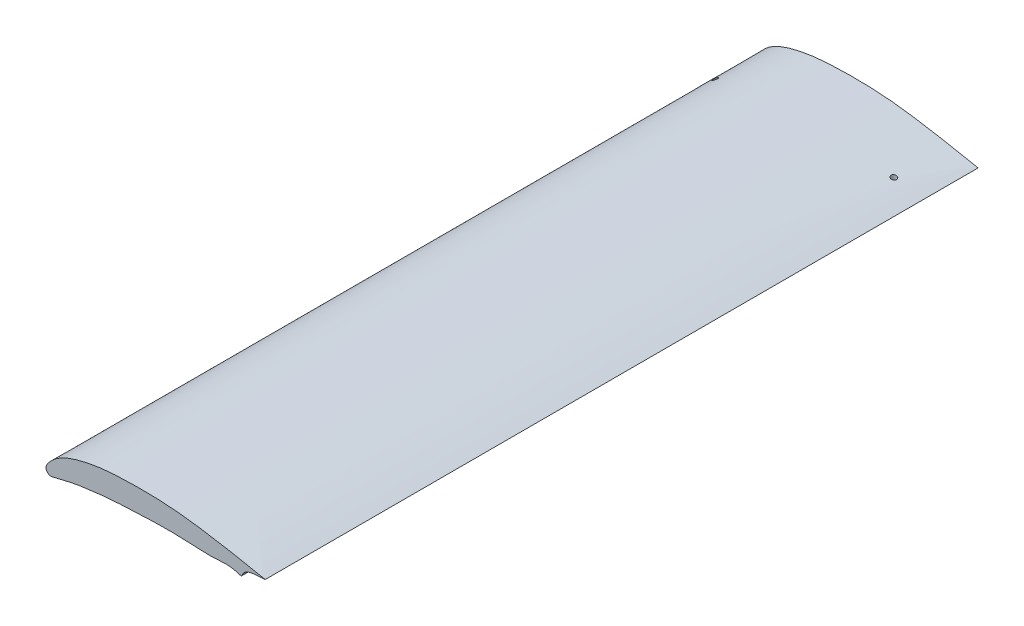
ISO-10303-21;
HEADER;
FILE_DESCRIPTION(('STEP AP214'),'2;1');
FILE_NAME('part.step','',(''),(''),'','','');
FILE_SCHEMA(('AUTOMOTIVE_DESIGN { 1 0 10303 214 1 1 1 1 }'));
ENDSEC;
DATA;
#1=APPLICATION_CONTEXT('core data for automotive mechanical design processes');
#2=APPLICATION_PROTOCOL_DEFINITION('international standard','automotive_design',2000,#1);
#3=PRODUCT_CONTEXT('',#1,'mechanical');
#4=PRODUCT('Part','Part','',(#3));
#5=PRODUCT_RELATED_PRODUCT_CATEGORY('part','',(#4));
#6=PRODUCT_DEFINITION_FORMATION('','',#4);
#7=PRODUCT_DEFINITION_CONTEXT('part definition',#1,'design');
#8=PRODUCT_DEFINITION('design','',#6,#7);
#9=PRODUCT_DEFINITION_SHAPE('','',#8);
#10=(LENGTH_UNIT() NAMED_UNIT(*) SI_UNIT(.MILLI.,.METRE.));
#11=(NAMED_UNIT(*) PLANE_ANGLE_UNIT() SI_UNIT($,.RADIAN.));
#12=(NAMED_UNIT(*) SI_UNIT($,.STERADIAN.) SOLID_ANGLE_UNIT());
#13=UNCERTAINTY_MEASURE_WITH_UNIT(LENGTH_MEASURE(1.E-05),#10,'distance_accuracy_value','');
#14=(GEOMETRIC_REPRESENTATION_CONTEXT(3) GLOBAL_UNCERTAINTY_ASSIGNED_CONTEXT((#13)) GLOBAL_UNIT_ASSIGNED_CONTEXT((#10,
#11,#12)) REPRESENTATION_CONTEXT('',''));
#15=CARTESIAN_POINT('',(0.,0.,0.));
#16=DIRECTION('',(0.,0.,1.));
#17=DIRECTION('',(1.,0.,0.));
#18=AXIS2_PLACEMENT_3D('',#15,#16,#17);
#19=CARTESIAN_POINT('',(198.755,12.4341128,647.7));
#20=CARTESIAN_POINT('',(197.958760534207,12.6748927876671,647.7));
#21=CARTESIAN_POINT('',(193.016318765984,13.5341691483497,647.7));
#22=CARTESIAN_POINT('',(188.294054353052,14.5184855232137,647.7));
#23=CARTESIAN_POINT('',(182.851726209752,15.5792373803848,647.7));
#24=CARTESIAN_POINT('',(170.951086300742,17.9688843917049,647.7));
#25=CARTESIAN_POINT('',(152.18858023146,21.2694516287347,647.7));
#26=CARTESIAN_POINT('',(126.821055620499,25.2076705512237,647.7));
#27=CARTESIAN_POINT('',(101.321432860715,27.1488490847707,647.7));
#28=CARTESIAN_POINT('',(75.878614337832,27.1749294150967,647.7));
#29=CARTESIAN_POINT('',(54.6349447143683,26.1939964805651,647.7));
#30=CARTESIAN_POINT('',(37.7206187463368,23.4738419295211,647.7));
#31=CARTESIAN_POINT('',(27.1377693436515,20.862450997991,647.7));
#32=CARTESIAN_POINT('',(18.6997974345567,17.8336240052125,647.7));
#33=CARTESIAN_POINT('',(12.2232756225657,14.7175392304468,647.7));
#34=CARTESIAN_POINT('',(6.86322263938597,10.8530181117352,647.7));
#35=CARTESIAN_POINT('',(2.51263926524156,6.22481514297062,647.7));
#36=CARTESIAN_POINT('',(-1.7331044962043,0.897280663114527,647.7));
#37=CARTESIAN_POINT('',(2.55754098739132,-4.25639395976814,647.7));
#38=CARTESIAN_POINT('',(7.56201719548681,-3.18649903825616,647.7));
#39=CARTESIAN_POINT('',(12.6976154233122,-1.98023294648634,647.7));
#40=CARTESIAN_POINT('',(19.0474899754093,-0.424332295492845,647.7));
#41=CARTESIAN_POINT('',(27.4304732379743,1.4859270437852,647.7));
#42=CARTESIAN_POINT('',(38.051074580332,2.87200975582277,647.7));
#43=CARTESIAN_POINT('',(54.9212142330804,5.06075420952236,647.7));
#44=CARTESIAN_POINT('',(76.0959932993087,6.25150550165955,647.7));
#45=CARTESIAN_POINT('',(101.556610570524,7.37317506510794,647.7));
#46=CARTESIAN_POINT('',(126.711669410679,7.31735993311027,647.7));
#47=CARTESIAN_POINT('',(152.222032299856,5.02865408070531,647.7));
#48=CARTESIAN_POINT('',(166.885209380243,7.94350036404351,647.7));
#49=CARTESIAN_POINT('',(177.478911207929,3.86078185870248,647.7));
#50=CARTESIAN_POINT('',(178.973218605266,7.14619357827708,647.7));
#51=CARTESIAN_POINT('',(183.205786263873,13.0926636509751,647.7));
#52=CARTESIAN_POINT('',(201.125228022937,11.7173642605855,647.7));
#53=CARTESIAN_POINT('',(198.755,12.4341128,647.7));
#54=B_SPLINE_CURVE_WITH_KNOTS('',3,(#19,#20,#21,#22,#23,#24,#25,#26,#27,#28,#29,#30,#31,#32,#33,
#34,#35,#36,#37,#38,#39,#40,#41,#42,#43,#44,#45,#46,#47,#48,#49,#50,#51,#52,#53),.UNSPECIFIED.,
.T.,.F.,(4,1,1,1,1,1,1,1,1,1,1,1,1,1,1,1,1,1,1,1,1,1,1,1,1,1,1,1,1,1,1,1,4),(0.,
0.0130652849117943,0.0261249114312724,0.0391939832046235,0.0522592681164178,0.114883725942391,
0.177153764537816,0.238898973149273,0.300426495876215,0.362023645270243,0.393128504191607,
0.424784776009081,0.44109166189645,0.458148008143755,0.477060579176118,0.48802083829335,
0.50604562016283,0.51777668525792,0.525474169458793,0.541223289905193,0.556994005380544,
0.572702865712309,0.603759277327333,0.634700771494563,0.696321727579434,0.757859990174522,
0.819389386006446,0.880956138609047,0.936472049316192,0.942641551592999,0.944142164687157,
0.961107548977415,1.),.UNSPECIFIED.);
#55=DIRECTION('',(0.,0.,-1.));
#56=VECTOR('',#55,1.);
#57=SURFACE_OF_LINEAR_EXTRUSION('',#54,#56);
#58=CARTESIAN_POINT('',(13.2315396177122,15.0484347914961,50.8));
#59=CARTESIAN_POINT('',(13.2315322849885,15.0484311890282,50.9313661934099));
#60=CARTESIAN_POINT('',(13.2215795019761,15.0428129120174,51.0627998767818));
#61=CARTESIAN_POINT('',(13.18221591222,15.020532771465,51.3218071664005));
#62=CARTESIAN_POINT('',(13.1527901057857,15.003862394688,51.4493777176731));
#63=CARTESIAN_POINT('',(13.0759224611812,14.9601209445801,51.6967403510377));
#64=CARTESIAN_POINT('',(13.0285208534924,14.9330730948285,51.8165491083259));
#65=CARTESIAN_POINT('',(12.917714636927,14.8694681568995,52.0457298351831));
#66=CARTESIAN_POINT('',(12.8543099674338,14.8329110327028,52.1551017652171));
#67=CARTESIAN_POINT('',(12.7112385623374,14.7498174506164,52.3650881315765));
#68=CARTESIAN_POINT('',(12.6310476956563,14.702955995544,52.4652152298003));
#69=CARTESIAN_POINT('',(12.4588552205819,14.6014441641143,52.6501535054709));
#70=CARTESIAN_POINT('',(12.366849857487,14.5467913110037,52.7349597931815));
#71=CARTESIAN_POINT('',(12.1642847509017,14.4252955478085,52.8958092744233));
#72=CARTESIAN_POINT('',(12.0527900547579,14.3577821554167,52.9701661809602));
#73=CARTESIAN_POINT('',(11.822295922671,14.21661016033,53.0986095726129));
#74=CARTESIAN_POINT('',(11.703292992956,14.1429486915542,53.1526865384665));
#75=CARTESIAN_POINT('',(11.4465143187519,13.9821025332321,53.2456650669561));
#76=CARTESIAN_POINT('',(11.3081777151838,13.8943466634967,53.2820309810548));
#77=CARTESIAN_POINT('',(11.0295756965157,13.7151865322346,53.3296802931591));
#78=CARTESIAN_POINT('',(10.8893094658056,13.6237806948229,53.3409527351401));
#79=CARTESIAN_POINT('',(10.5954765507619,13.4296681915411,53.3388158833271));
#80=CARTESIAN_POINT('',(10.4420472708968,13.3267766019868,53.3227117642547));
#81=CARTESIAN_POINT('',(10.1405949124551,13.1216094250332,53.261209581994));
#82=CARTESIAN_POINT('',(9.99257600979395,13.0193343622934,53.2157893758862));
#83=CARTESIAN_POINT('',(9.69967005161016,12.8140724555134,53.0936287013672));
#84=CARTESIAN_POINT('',(9.55519564645956,12.7112463018795,53.0156180440947));
#85=CARTESIAN_POINT('',(9.28132237661272,12.513670915777,52.8289349823251));
#86=CARTESIAN_POINT('',(9.15190463156049,12.4189116087671,52.7203015757636));
#87=CARTESIAN_POINT('',(8.94267686371422,12.2639296192098,52.5034916692055));
#88=CARTESIAN_POINT('',(8.85844065511549,12.2008982639155,52.4015652530145));
#89=CARTESIAN_POINT('',(8.7048109550114,12.0850795703158,52.1817077467296));
#90=CARTESIAN_POINT('',(8.63540974224333,12.0322869043489,52.0637850348277));
#91=CARTESIAN_POINT('',(8.54475881301422,11.9629403757375,51.8761562338837));
#92=CARTESIAN_POINT('',(8.5166831679517,11.9413869702349,51.8114903592339));
#93=CARTESIAN_POINT('',(8.46559023617875,11.9020655185663,51.6790953262595));
#94=CARTESIAN_POINT('',(8.44257019960163,11.8842954147335,51.6113678575047));
#95=CARTESIAN_POINT('',(8.40199264806558,11.8529118372569,51.4734047548836));
#96=CARTESIAN_POINT('',(8.38443186776419,11.8392958789868,51.4031706484479));
#97=CARTESIAN_POINT('',(8.35509044936922,11.8165163722954,51.2607995165565));
#98=CARTESIAN_POINT('',(8.34330874791038,11.807352004773,51.1886628437538));
#99=CARTESIAN_POINT('',(8.3270088251908,11.7946649802624,51.0535306445394));
#100=CARTESIAN_POINT('',(8.32169843927913,11.7905272965369,50.9906867836345));
#101=CARTESIAN_POINT('',(8.3155950066163,11.78577125844,50.8646244707102));
#102=CARTESIAN_POINT('',(8.3148033772124,11.7851540082832,50.8014059073854));
#103=CARTESIAN_POINT('',(8.31775616790872,11.7874553718774,50.6751816447847));
#104=CARTESIAN_POINT('',(8.32149738263138,11.7903714870271,50.6121758266467));
#105=CARTESIAN_POINT('',(8.33344454364528,11.799675116304,50.4868402016706));
#106=CARTESIAN_POINT('',(8.34165216043134,11.8060639292661,50.4245106566696));
#107=CARTESIAN_POINT('',(8.37137774970867,11.8291721064418,50.2477903185408));
#108=CARTESIAN_POINT('',(8.39827145726279,11.8500499120184,50.1347811603276));
#109=CARTESIAN_POINT('',(8.46582019533859,11.9022560756455,49.9156045408629));
#110=CARTESIAN_POINT('',(8.50647753151005,11.9335861846278,49.809438229458));
#111=CARTESIAN_POINT('',(8.60308510147422,12.0076057951546,49.5987948190004));
#112=CARTESIAN_POINT('',(8.65989517211755,12.0509286215046,49.4949366957694));
#113=CARTESIAN_POINT('',(8.78517132066887,12.1457661503275,49.2986645074915));
#114=CARTESIAN_POINT('',(8.85364300748937,12.1972847939704,49.2062559865054));
#115=CARTESIAN_POINT('',(9.01148317655401,12.3150695043584,49.0205325985599));
#116=CARTESIAN_POINT('',(9.10244601680173,12.3823859656702,48.9292412069546));
#117=CARTESIAN_POINT('',(9.29456704463545,12.5230819413099,48.7636778537828));
#118=CARTESIAN_POINT('',(9.39573132297943,12.59646507297,48.6894161474317));
#119=CARTESIAN_POINT('',(9.62369411825985,12.7599966745476,48.5472352386966));
#120=CARTESIAN_POINT('',(9.75194171874278,12.8508884723797,48.4824857863808));
#121=CARTESIAN_POINT('',(10.0160692899433,13.0355560833673,48.3771331283401));
#122=CARTESIAN_POINT('',(10.1519536821747,13.1293335527396,48.3365440718395));
#123=CARTESIAN_POINT('',(10.4441562747405,13.3282192609752,48.2767795017799));
#124=CARTESIAN_POINT('',(10.6010399992105,13.4334024050491,48.2605667308384));
#125=CARTESIAN_POINT('',(10.9163911987713,13.6416090196084,48.259461786156));
#126=CARTESIAN_POINT('',(11.0748591379311,13.7446318281525,48.2745790744998));
#127=CARTESIAN_POINT('',(11.3907531848853,13.9469565404663,48.3373641346888));
#128=CARTESIAN_POINT('',(11.5481434658291,14.0461983130007,48.3854236820776));
#129=CARTESIAN_POINT('',(11.7774050285613,14.1887340850455,48.4823892415273));
#130=CARTESIAN_POINT('',(11.8527238069716,14.2352129519521,48.5188813512439));
#131=CARTESIAN_POINT('',(12.0003175914266,14.325672833576,48.6001339613381));
#132=CARTESIAN_POINT('',(12.0725944309023,14.3696553586214,48.6448893910244));
#133=CARTESIAN_POINT('',(12.2073136344919,14.4511079079645,48.7384331382068));
#134=CARTESIAN_POINT('',(12.2700712846313,14.4888143264194,48.7865628116069));
#135=CARTESIAN_POINT('',(12.3915850015946,14.5614192967877,48.8894612184962));
#136=CARTESIAN_POINT('',(12.4503434741955,14.5963195391404,48.9442259044466));
#137=CARTESIAN_POINT('',(12.5631395898419,14.6629752274741,49.0601278690422));
#138=CARTESIAN_POINT('',(12.6171787097992,14.6947316577234,49.1212631407946));
#139=CARTESIAN_POINT('',(12.7197977847176,14.7547619364637,49.2495309087132));
#140=CARTESIAN_POINT('',(12.7683786919852,14.7830363925456,49.3166623550329));
#141=CARTESIAN_POINT('',(12.8534840596834,14.8323726131557,49.4474084452876));
#142=CARTESIAN_POINT('',(12.8907555326212,14.8538943255919,49.5103645878932));
#143=CARTESIAN_POINT('',(12.9601170460225,14.8938264358991,49.6400023825987));
#144=CARTESIAN_POINT('',(12.9922079339293,14.9122373426607,49.7066834229704));
#145=CARTESIAN_POINT('',(13.050733402202,14.945731757139,49.8431697254687));
#146=CARTESIAN_POINT('',(13.0771762494525,14.9608201289763,49.9129702380875));
#147=CARTESIAN_POINT('',(13.1240773375714,14.9875313002805,50.0551642657139));
#148=CARTESIAN_POINT('',(13.1445374640806,14.9991551917086,50.1275569556241));
#149=CARTESIAN_POINT('',(13.184862102967,15.0220351556491,50.2984423461881));
#150=CARTESIAN_POINT('',(13.2023265661239,15.0319180398842,50.3977022034573));
#151=CARTESIAN_POINT('',(13.2256673819954,15.045118811827,50.5979615522002));
#152=CARTESIAN_POINT('',(13.231545257614,15.0484375623036,50.6989608132916));
#153=CARTESIAN_POINT('',(13.2315396177122,15.0484347914961,50.8));
#154=B_SPLINE_CURVE_WITH_KNOTS('',3,(#58,#59,#60,#61,#62,#63,#64,#65,#66,#67,#68,#69,#70,#71,
#72,#73,#74,#75,#76,#77,#78,#79,#80,#81,#82,#83,#84,#85,#86,#87,#88,#89,#90,#91,#92,#93,#94,#95,
#96,#97,#98,#99,#100,#101,#102,#103,#104,#105,#106,#107,#108,#109,#110,#111,#112,#113,#114,#115,
#116,#117,#118,#119,#120,#121,#122,#123,#124,#125,#126,#127,#128,#129,#130,#131,#132,#133,#134,
#135,#136,#137,#138,#139,#140,#141,#142,#143,#144,#145,#146,#147,#148,#149,#150,#151,#152,#153),
.UNSPECIFIED.,.T.,.F.,(4,2,2,2,2,2,2,2,2,2,2,2,2,2,2,2,2,2,2,2,2,2,2,2,2,2,2,2,2,2,2,2,2,2,2,2,
2,2,2,2,2,2,2,2,2,2,2,4),(0.,0.393728209990927,0.787760054717573,1.18091519737844,
1.57407182926023,1.98209047111918,2.39023910560192,2.83859535465758,3.28716179636661,
3.78853029000402,4.29011764251876,4.84398146192904,5.39826411406561,5.97653059762444,
6.55406396272133,6.99184923096567,7.4294060845654,7.6502865700373,7.87104661411498,
8.09167435990135,8.31226149437675,8.50161991813696,8.69103773255153,8.88032167926846,
9.06967646944899,9.42206631269688,9.77451521667437,10.151217495382,10.5281014717229,
10.9626343083581,11.3974281359493,11.905381835934,12.4136327205238,12.9797264572076,
13.5459911864636,14.119109971282,14.4059532937221,14.6926211795619,14.9551076740522,
15.2174348433218,15.4796796214305,15.7418785738114,15.9703483509682,16.1987807169458,
16.4268764060455,16.6549001260026,16.957772630271,17.2606053232875),.UNSPECIFIED.);
#155=CARTESIAN_POINT('',(13.2315396177122,15.0484347914961,50.8));
#156=VERTEX_POINT('',#155);
#157=EDGE_CURVE('E44',#156,#156,#154,.T.);
#158=ORIENTED_EDGE('',*,*,#157,.T.);
#159=EDGE_LOOP('',(#158));
#160=FACE_BOUND('',#159,.T.);
#161=CARTESIAN_POINT('',(14.1056423701573,-1.63043930702744,50.7999999999999));
#162=CARTESIAN_POINT('',(14.1056359002599,-1.63044088544523,50.6591207650782));
#163=CARTESIAN_POINT('',(14.0940100932554,-1.63324953335712,50.518138068398));
#164=CARTESIAN_POINT('',(14.0478295900166,-1.6444046447402,50.2400881548447));
#165=CARTESIAN_POINT('',(14.0132471244181,-1.65275781510372,50.103025890002));
#166=CARTESIAN_POINT('',(13.9222520317104,-1.67473151991666,49.836920209636));
#167=CARTESIAN_POINT('',(13.8658577515508,-1.68834762745432,49.7078701602522));
#168=CARTESIAN_POINT('',(13.7329740463239,-1.72041887761804,49.4612797076177));
#169=CARTESIAN_POINT('',(13.6564889800746,-1.73887297061209,49.3437368154032));
#170=CARTESIAN_POINT('',(13.4850342934077,-1.78021666160759,49.1224363265474));
#171=CARTESIAN_POINT('',(13.3899284640594,-1.80313893810291,49.0187904169811));
#172=CARTESIAN_POINT('',(13.184376540603,-1.85263965595237,48.8290714285328));
#173=CARTESIAN_POINT('',(13.0739287249683,-1.8792185076081,48.7430003244029));
#174=CARTESIAN_POINT('',(12.8389272838399,-1.93570789423596,48.5894023221915));
#175=CARTESIAN_POINT('',(12.7141752125168,-1.96566517310938,48.522196238672));
#176=CARTESIAN_POINT('',(12.4555669122732,-2.02767742658107,48.4099117805263));
#177=CARTESIAN_POINT('',(12.3217099091568,-2.05973257955362,48.3648352902729));
#178=CARTESIAN_POINT('',(12.0465376417516,-2.12551838522368,48.2974402664555));
#179=CARTESIAN_POINT('',(11.9051408138995,-2.15926691807164,48.2754718991183));
#180=CARTESIAN_POINT('',(11.6207305827922,-2.22701823433337,48.2560607103547));
#181=CARTESIAN_POINT('',(11.4777170967868,-2.26102103073143,48.2586191500864));
#182=CARTESIAN_POINT('',(11.1930646403468,-2.32855650318531,48.2883175805383));
#183=CARTESIAN_POINT('',(11.0514425480505,-2.36208415256104,48.315631320185));
#184=CARTESIAN_POINT('',(10.7746646851465,-2.42746225620204,48.3943955374379));
#185=CARTESIAN_POINT('',(10.6395088904564,-2.45931271671371,48.4458459251442));
#186=CARTESIAN_POINT('',(10.380104165388,-2.52030687215419,48.5712996517289));
#187=CARTESIAN_POINT('',(10.2558152861222,-2.54946050624868,48.6452154902817));
#188=CARTESIAN_POINT('',(10.0212614707003,-2.60436220065034,48.8136902290561));
#189=CARTESIAN_POINT('',(9.91099566226898,-2.63011047278479,48.9082478443051));
#190=CARTESIAN_POINT('',(9.70914868177326,-2.67715552810202,49.1140706327464));
#191=CARTESIAN_POINT('',(9.61734883322132,-2.6985044929569,49.22510937103));
#192=CARTESIAN_POINT('',(9.45353863058069,-2.7365423885127,49.4616443471345));
#193=CARTESIAN_POINT('',(9.38152653528017,-2.75323172923661,49.5871393115081));
#194=CARTESIAN_POINT('',(9.26051029784535,-2.78124767565336,49.8469349462055));
#195=CARTESIAN_POINT('',(9.21116750480527,-2.79265323752397,49.9810693880785));
#196=CARTESIAN_POINT('',(9.13541350615318,-2.8101534782741,50.2559941343449));
#197=CARTESIAN_POINT('',(9.10900059176602,-2.81624855290065,50.3967839419439));
#198=CARTESIAN_POINT('',(9.0801111469783,-2.82291470471949,50.6792639133506));
#199=CARTESIAN_POINT('',(9.07735949936203,-2.82354927304987,50.8209245077723));
#200=CARTESIAN_POINT('',(9.09515599784276,-2.81944327955315,51.1026921928639));
#201=CARTESIAN_POINT('',(9.1157033880526,-2.81470289210492,51.2427993337834));
#202=CARTESIAN_POINT('',(9.17935052135563,-2.80000502985702,51.5170097150136));
#203=CARTESIAN_POINT('',(9.22237501724347,-2.79006496202279,51.6511313768034));
#204=CARTESIAN_POINT('',(9.3296161079319,-2.76525389635712,51.9101218629536));
#205=CARTESIAN_POINT('',(9.39383308999256,-2.75038280841885,52.0349905181784));
#206=CARTESIAN_POINT('',(9.54198633036902,-2.71601303193683,52.2727828800937));
#207=CARTESIAN_POINT('',(9.62604017199237,-2.6964867422897,52.385629300068));
#208=CARTESIAN_POINT('',(9.81116859085435,-2.65339080929964,52.5954694617799));
#209=CARTESIAN_POINT('',(9.91224421005577,-2.62982091843202,52.6924622323433));
#210=CARTESIAN_POINT('',(10.1299438020108,-2.57894086416272,52.869227481127));
#211=CARTESIAN_POINT('',(10.2467551616584,-2.55158549407073,52.9487561199039));
#212=CARTESIAN_POINT('',(10.4915347516541,-2.49412674263428,53.0868960590585));
#213=CARTESIAN_POINT('',(10.6195038773955,-2.46402314073937,53.1455056787918));
#214=CARTESIAN_POINT('',(10.8850516253359,-2.40141015782553,53.241064634487));
#215=CARTESIAN_POINT('',(11.0227469730838,-2.36887110488155,53.2776702608422));
#216=CARTESIAN_POINT('',(11.3021091100338,-2.3027074128316,53.3268957937962));
#217=CARTESIAN_POINT('',(11.4437761875492,-2.26908269488868,53.3395139545127));
#218=CARTESIAN_POINT('',(11.7287128019531,-2.20131644512263,53.340463567553));
#219=CARTESIAN_POINT('',(11.8719829128922,-2.16717328392113,53.3285277863771));
#220=CARTESIAN_POINT('',(12.1545293975912,-2.09971954691095,53.2801413835387));
#221=CARTESIAN_POINT('',(12.2938056610729,-2.06640899409556,53.2436900856305));
#222=CARTESIAN_POINT('',(12.5645875697853,-2.00155084137826,53.147146056854));
#223=CARTESIAN_POINT('',(12.6960819105185,-1.97000580962186,53.0870198592541));
#224=CARTESIAN_POINT('',(12.9472405965886,-1.90968365619012,52.9447136305994));
#225=CARTESIAN_POINT('',(13.0669058497322,-1.88090632211632,52.8625352937059));
#226=CARTESIAN_POINT('',(13.2897549098596,-1.82727035241211,52.6792321683838));
#227=CARTESIAN_POINT('',(13.3930846499068,-1.80237704853852,52.5782950175401));
#228=CARTESIAN_POINT('',(13.5814928872196,-1.75696175996016,52.3597200878312));
#229=CARTESIAN_POINT('',(13.6665683496502,-1.73644050212671,52.2420795373639));
#230=CARTESIAN_POINT('',(13.8145850977559,-1.70072445588786,51.995445631288));
#231=CARTESIAN_POINT('',(13.8778518789344,-1.68545135058422,51.8666587078039));
#232=CARTESIAN_POINT('',(13.9820191582097,-1.66029976132539,51.5999717163757));
#233=CARTESIAN_POINT('',(14.0229494877323,-1.65041408222276,51.462084080305));
#234=CARTESIAN_POINT('',(14.0698766523244,-1.6390791687287,51.2360264797968));
#235=CARTESIAN_POINT('',(14.0832705027888,-1.63584370524876,51.1494098791279));
#236=CARTESIAN_POINT('',(14.1011553336132,-1.63152329322803,50.9752088549669));
#237=CARTESIAN_POINT('',(14.1056463943212,-1.63043832527895,50.8876244402165));
#238=CARTESIAN_POINT('',(14.1056423701573,-1.63043930702744,50.7999999999999));
#239=B_SPLINE_CURVE_WITH_KNOTS('',3,(#161,#162,#163,#164,#165,#166,#167,#168,#169,#170,#171,
#172,#173,#174,#175,#176,#177,#178,#179,#180,#181,#182,#183,#184,#185,#186,#187,#188,#189,#190,
#191,#192,#193,#194,#195,#196,#197,#198,#199,#200,#201,#202,#203,#204,#205,#206,#207,#208,#209,
#210,#211,#212,#213,#214,#215,#216,#217,#218,#219,#220,#221,#222,#223,#224,#225,#226,#227,#228,
#229,#230,#231,#232,#233,#234,#235,#236,#237,#238),.UNSPECIFIED.,.T.,.F.,(4,2,2,2,2,2,2,2,2,2,2,
2,2,2,2,2,2,2,2,2,2,2,2,2,2,2,2,2,2,2,2,2,2,2,2,2,2,2,4),(0.,0.422314922958448,
0.845141629421219,1.26761344710904,1.68999368256644,2.11558752159738,2.54122915520778,
2.97372246799858,3.4062526019525,3.84524655054166,4.28426307213605,4.72638496521152,
5.1685052115621,5.60892505119286,6.04931748203172,6.48414003337103,6.91892431049149,
7.34698348188117,7.77501075080481,8.19805438046061,8.62108428576863,9.04270699264542,
9.46433740445502,9.88853275355587,10.3127540785885,10.7425672229118,11.1724148908702,
11.6088133337503,12.0452435378507,12.4864487631986,12.927666159426,13.3695095107098,
13.8113189269785,14.2489262054784,14.6866061813814,15.1174379821943,15.5476929690018,
15.8103678956282,16.0730404515938),.UNSPECIFIED.);
#240=CARTESIAN_POINT('',(14.1056423701573,-1.63043930702744,50.7999999999999));
#241=VERTEX_POINT('',#240);
#242=EDGE_CURVE('E107',#241,#241,#239,.T.);
#243=ORIENTED_EDGE('',*,*,#242,.T.);
#244=EDGE_LOOP('',(#243));
#245=FACE_BOUND('',#244,.T.);
#246=CARTESIAN_POINT('',(175.914710282943,16.954981902588,50.8));
#247=CARTESIAN_POINT('',(175.914703492226,16.954983259304,50.9395651484845));
#248=CARTESIAN_POINT('',(175.903028243029,16.9572455696789,51.0792344305187));
#249=CARTESIAN_POINT('',(175.85667812831,16.9662230583004,51.3546695199144));
#250=CARTESIAN_POINT('',(175.821975075049,16.9729436938648,51.4904303302482));
#251=CARTESIAN_POINT('',(175.730757143087,16.9905966825293,51.7539563448168));
#252=CARTESIAN_POINT('',(175.674266500912,17.0015243556942,51.8817302508018));
#253=CARTESIAN_POINT('',(175.541299253365,17.027221558128,52.1259355581518));
#254=CARTESIAN_POINT('',(175.464826545349,17.0419903382146,52.2423691652864));
#255=CARTESIAN_POINT('',(175.293114071365,17.0751139228384,52.4623585802182));
#256=CARTESIAN_POINT('',(175.197642821906,17.0935129329039,52.5657268862747));
#257=CARTESIAN_POINT('',(174.991414723389,17.1332029479179,52.7552187871989));
#258=CARTESIAN_POINT('',(174.880655444658,17.1544944125456,52.841339635646));
#259=CARTESIAN_POINT('',(174.64369948167,17.1999768009592,52.9964443624902));
#260=CARTESIAN_POINT('',(174.517158304908,17.2242320470949,53.0648830701911));
#261=CARTESIAN_POINT('',(174.254781200709,17.2744415928359,53.1797926193216));
#262=CARTESIAN_POINT('',(174.118943932982,17.3003961374191,53.2262602853404));
#263=CARTESIAN_POINT('',(173.838022698228,17.3539808228254,53.2970900386506));
#264=CARTESIAN_POINT('',(173.692789864308,17.3816370253969,53.3208428122257));
#265=CARTESIAN_POINT('',(173.400442096881,17.4372101618598,53.3435525016485));
#266=CARTESIAN_POINT('',(173.253326985609,17.4651271203093,53.3425070579605));
#267=CARTESIAN_POINT('',(172.959332302392,17.5208205654661,53.3154480672281));
#268=CARTESIAN_POINT('',(172.8124817249,17.5485902800301,53.2891036010073));
#269=CARTESIAN_POINT('',(172.525228635226,17.6028206309313,53.2115678700295));
#270=CARTESIAN_POINT('',(172.384826145989,17.6292812626103,53.1603765168645));
#271=CARTESIAN_POINT('',(172.115351487836,17.6799901222416,53.0347294713662));
#272=CARTESIAN_POINT('',(171.986222207655,17.7042495298365,52.9604009518001));
#273=CARTESIAN_POINT('',(171.74240827959,17.7499935801056,52.7902783568312));
#274=CARTESIAN_POINT('',(171.627722089979,17.7714785189467,52.6944865755636));
#275=CARTESIAN_POINT('',(171.41878200055,17.8105769710914,52.4863150225836));
#276=CARTESIAN_POINT('',(171.324139257109,17.8282642760265,52.374339603189));
#277=CARTESIAN_POINT('',(171.155312073035,17.8597885847347,52.1354185550999));
#278=CARTESIAN_POINT('',(171.081124222782,17.8736262302098,52.0084754264112));
#279=CARTESIAN_POINT('',(170.957505906511,17.896670166062,51.7470576047541));
#280=CARTESIAN_POINT('',(170.907439186371,17.9059955122753,51.6128941798973));
#281=CARTESIAN_POINT('',(170.830718466101,17.9202810292484,51.3378125858172));
#282=CARTESIAN_POINT('',(170.804061114481,17.9252418248755,51.1968953865704));
#283=CARTESIAN_POINT('',(170.77539140986,17.9305769557877,50.9156065346233));
#284=CARTESIAN_POINT('',(170.772854386474,17.9310489328659,50.7752899771086));
#285=CARTESIAN_POINT('',(170.791139053542,17.9276465403794,50.4962469173264));
#286=CARTESIAN_POINT('',(170.811959364643,17.92377242747,50.3575203216535));
#287=CARTESIAN_POINT('',(170.876060701945,17.911838911154,50.0864746826829));
#288=CARTESIAN_POINT('',(170.919200584396,17.9038058080122,49.9541210212731));
#289=CARTESIAN_POINT('',(171.026469249811,17.8838165468284,49.6985388980234));
#290=CARTESIAN_POINT('',(171.090598800377,17.8718602453128,49.5753107701113));
#291=CARTESIAN_POINT('',(171.238704289438,17.8442210639397,49.3398956529307));
#292=CARTESIAN_POINT('',(171.322899552086,17.8284969900968,49.2278516103817));
#293=CARTESIAN_POINT('',(171.508176807827,17.7938547058766,49.019306942931));
#294=CARTESIAN_POINT('',(171.609260651204,17.7749361455145,48.9228080234034));
#295=CARTESIAN_POINT('',(171.828027108465,17.733937722758,48.7455719408469));
#296=CARTESIAN_POINT('',(171.946052338653,17.7117924123795,48.6652729438097));
#297=CARTESIAN_POINT('',(172.193384972593,17.6653148020188,48.5253522375233));
#298=CARTESIAN_POINT('',(172.32269394254,17.6409821984235,48.4657334044373));
#299=CARTESIAN_POINT('',(172.592684138148,17.5900951559654,48.3672028860077));
#300=CARTESIAN_POINT('',(172.733578904975,17.5634983094819,48.3288979022505));
#301=CARTESIAN_POINT('',(173.019627723866,17.5094078055164,48.276402070671));
#302=CARTESIAN_POINT('',(173.164782296537,17.4819140383718,48.2622141828863));
#303=CARTESIAN_POINT('',(173.458162333675,17.426248469669,48.2582282548903));
#304=CARTESIAN_POINT('',(173.606393807135,17.3980737012838,48.2688981018427));
#305=CARTESIAN_POINT('',(173.89900180918,17.3423604443326,48.3153479044103));
#306=CARTESIAN_POINT('',(174.043378156122,17.3148219857561,48.351129041052));
#307=CARTESIAN_POINT('',(174.324456953572,17.2611203616405,48.4470595825496));
#308=CARTESIAN_POINT('',(174.461141382826,17.2349604342617,48.5072637048983));
#309=CARTESIAN_POINT('',(174.722397430021,17.1848829889361,48.6505535135051));
#310=CARTESIAN_POINT('',(174.846970311986,17.1609652369934,48.7336368084974));
#311=CARTESIAN_POINT('',(175.078185460876,17.1165133369261,48.9189724898353));
#312=CARTESIAN_POINT('',(175.185089551768,17.095929892763,49.0208861509825));
#313=CARTESIAN_POINT('',(175.380002822414,17.0583604024204,49.2420444149861));
#314=CARTESIAN_POINT('',(175.468010113964,17.041374715738,49.3612907477618));
#315=CARTESIAN_POINT('',(175.619974195,17.0120211766662,49.6101631438243));
#316=CARTESIAN_POINT('',(175.684528197408,16.9995387229563,49.7394114832478));
#317=CARTESIAN_POINT('',(175.79066058945,16.9790059261226,50.0072169890666));
#318=CARTESIAN_POINT('',(175.832272260174,16.9709491629726,50.145760342496));
#319=CARTESIAN_POINT('',(175.879317121088,16.9618383677613,50.3711204302608));
#320=CARTESIAN_POINT('',(175.892570379689,16.9592710632779,50.4563215654338));
#321=CARTESIAN_POINT('',(175.910268991459,16.9558424245476,50.6276685729935));
#322=CARTESIAN_POINT('',(175.914714476411,16.9549810647762,50.7138144312258));
#323=CARTESIAN_POINT('',(175.914710282943,16.954981902588,50.8));
#324=B_SPLINE_CURVE_WITH_KNOTS('',3,(#246,#247,#248,#249,#250,#251,#252,#253,#254,#255,#256,
#257,#258,#259,#260,#261,#262,#263,#264,#265,#266,#267,#268,#269,#270,#271,#272,#273,#274,#275,
#276,#277,#278,#279,#280,#281,#282,#283,#284,#285,#286,#287,#288,#289,#290,#291,#292,#293,#294,
#295,#296,#297,#298,#299,#300,#301,#302,#303,#304,#305,#306,#307,#308,#309,#310,#311,#312,#313,
#314,#315,#316,#317,#318,#319,#320,#321,#322,#323),.UNSPECIFIED.,.T.,.F.,(4,2,2,2,2,2,2,2,2,2,2,
2,2,2,2,2,2,2,2,2,2,2,2,2,2,2,2,2,2,2,2,2,2,2,2,2,2,2,4),(0.,0.418375628992844,
0.837264327827604,1.25568839239002,1.67403090724918,2.09782273748526,2.52168199718481,
2.95736716013915,3.3931152721712,3.84024891215532,4.28742509681227,4.74053130284378,
5.19363912108696,5.64429915651352,6.09491104538011,6.53576017773271,6.97653578058066,
7.40494376080294,7.83329039640492,8.25229765154263,8.67128016379337,9.08764493919692,
9.50402494298178,9.92518361319761,10.3463884551112,10.7777909450254,11.2092534096543,
11.6524401009114,12.0956811832332,12.5473324352282,12.9990049305713,13.4516949957171,
13.904337764937,14.3495157346059,14.7947381666285,15.2276617989864,15.659955750937,
15.9183188269189,16.1766780372055),.UNSPECIFIED.);
#325=CARTESIAN_POINT('',(175.914710282943,16.954981902588,50.8));
#326=VERTEX_POINT('',#325);
#327=EDGE_CURVE('E76',#326,#326,#324,.T.);
#328=ORIENTED_EDGE('',*,*,#327,.T.);
#329=EDGE_LOOP('',(#328));
#330=FACE_BOUND('',#329,.T.);
#331=CARTESIAN_POINT('',(176.57873714921,4.28459450303518,50.8));
#332=CARTESIAN_POINT('',(176.578729805934,4.28458738549922,50.6625881566888));
#333=CARTESIAN_POINT('',(176.567427181324,4.28655562008979,50.5250740772039));
#334=CARTESIAN_POINT('',(176.522496313061,4.29509261651692,50.2537757489818));
#335=CARTESIAN_POINT('',(176.488843697818,4.30166640091408,50.1199957381929));
#336=CARTESIAN_POINT('',(176.400250657302,4.32101223945751,49.860058796061));
#337=CARTESIAN_POINT('',(176.345301421895,4.33378685936131,49.7339050446019));
#338=CARTESIAN_POINT('',(176.216146617715,4.3669558434388,49.493069325076));
#339=CARTESIAN_POINT('',(176.141952714605,4.38734559478202,49.3783804654103));
#340=CARTESIAN_POINT('',(175.978064967655,4.43579285603599,49.1646477302544));
#341=CARTESIAN_POINT('',(175.888551448573,4.46376315176551,49.065444988253));
#342=CARTESIAN_POINT('',(175.696426853105,4.52645066163588,48.8830431348994));
#343=CARTESIAN_POINT('',(175.593807165385,4.56117231962862,48.7998546365372));
#344=CARTESIAN_POINT('',(175.429208586254,4.61765600745538,48.6858444503048));
#345=CARTESIAN_POINT('',(175.37086407892,4.63781547702514,48.648817694241));
#346=CARTESIAN_POINT('',(175.251630863597,4.67892433089863,48.5796116112774));
#347=CARTESIAN_POINT('',(175.190742073775,4.69987374060721,48.5474324404447));
#348=CARTESIAN_POINT('',(175.00472385314,4.76332759656709,48.4583222729088));
#349=CARTESIAN_POINT('',(174.876185164095,4.806457968091,48.4087790943453));
#350=CARTESIAN_POINT('',(174.599067956852,4.89780710548671,48.3261934664139));
#351=CARTESIAN_POINT('',(174.44981496155,4.94607756038857,48.2954770568808));
#352=CARTESIAN_POINT('',(174.147899547845,5.04165434620909,48.2601673388355));
#353=CARTESIAN_POINT('',(173.995236305674,5.08896043878467,48.2555804120903));
#354=CARTESIAN_POINT('',(173.687768591797,5.18213792651048,48.2731607510682));
#355=CARTESIAN_POINT('',(173.532979199637,5.22796441228719,48.2958427606831));
#356=CARTESIAN_POINT('',(173.228917325647,5.31593116497429,48.368767414775));
#357=CARTESIAN_POINT('',(173.079644169036,5.35807188361913,48.4190066762805));
#358=CARTESIAN_POINT('',(172.795900110494,5.43638717417228,48.5443169009478));
#359=CARTESIAN_POINT('',(172.661118979103,5.47270310271512,48.6185952737795));
#360=CARTESIAN_POINT('',(172.406046623909,5.54003390645375,48.7907209144584));
#361=CARTESIAN_POINT('',(172.285750832916,5.57105045382992,48.8885607241025));
#362=CARTESIAN_POINT('',(172.06985831876,5.62571774825048,49.0996201739521));
#363=CARTESIAN_POINT('',(171.973308568616,5.64966559731535,49.2117880928073));
#364=CARTESIAN_POINT('',(171.800785705647,5.69185990945201,49.4519165423697));
#365=CARTESIAN_POINT('',(171.724806824359,5.71010797107345,49.5798726310924));
#366=CARTESIAN_POINT('',(171.599284953142,5.73995366652436,49.8415259287906));
#367=CARTESIAN_POINT('',(171.548683622288,5.75181938981149,49.9746855293047));
#368=CARTESIAN_POINT('',(171.470646475559,5.77002112192094,50.2479856980874));
#369=CARTESIAN_POINT('',(171.443206395905,5.77635814853368,50.3881249764275));
#370=CARTESIAN_POINT('',(171.412919246438,5.78334785877797,50.6672207340826));
#371=CARTESIAN_POINT('',(171.409410322133,5.78415352530902,50.8061019687542));
#372=CARTESIAN_POINT('',(171.425350062977,5.78047989766752,51.0824628695927));
#373=CARTESIAN_POINT('',(171.444797003235,5.7760010005741,51.2199426402818));
#374=CARTESIAN_POINT('',(171.505741734134,5.76184871776793,51.4885722917989));
#375=CARTESIAN_POINT('',(171.547077191919,5.75221356711621,51.6197611174586));
#376=CARTESIAN_POINT('',(171.650294237294,5.72786313785025,51.8732730059012));
#377=CARTESIAN_POINT('',(171.712176343807,5.71314773092977,51.9955958446714));
#378=CARTESIAN_POINT('',(171.855329663961,5.67858224239595,52.2296064003161));
#379=CARTESIAN_POINT('',(171.936830273341,5.65867115795512,52.341144591315));
#380=CARTESIAN_POINT('',(172.11616917339,5.6140593510913,52.5490819383944));
#381=CARTESIAN_POINT('',(172.2140092686,5.58935809959082,52.6454794200416));
#382=CARTESIAN_POINT('',(172.426296553877,5.53468966882931,52.8237025225883));
#383=CARTESIAN_POINT('',(172.541164819914,5.50458288437755,52.9049832310895));
#384=CARTESIAN_POINT('',(172.781647294748,5.44018251788354,53.0475001542293));
#385=CARTESIAN_POINT('',(172.907263911917,5.40588799676017,53.1087318615949));
#386=CARTESIAN_POINT('',(173.171727121115,5.33209638661886,53.2124732640658));
#387=CARTESIAN_POINT('',(173.310916697135,5.29243228791308,53.2539890946205));
#388=CARTESIAN_POINT('',(173.59337571599,5.2101163386185,53.3134570420977));
#389=CARTESIAN_POINT('',(173.736645919825,5.16746392854313,53.3314047339906));
#390=CARTESIAN_POINT('',(174.03068706637,5.0780297827657,53.3440474098986));
#391=CARTESIAN_POINT('',(174.181478430646,5.03114815199223,53.3375480935908));
#392=CARTESIAN_POINT('',(174.479610368617,4.93649257966558,53.2990059006556));
#393=CARTESIAN_POINT('',(174.626949514188,4.8887182830247,53.2669526383505));
#394=CARTESIAN_POINT('',(174.844432795855,4.816855482758,53.1997153132532));
#395=CARTESIAN_POINT('',(174.917399041286,4.79250315809369,53.1735683744175));
#396=CARTESIAN_POINT('',(175.060861379027,4.74417228491201,53.1148572204053));
#397=CARTESIAN_POINT('',(175.131357318576,4.72019375956086,53.0822926091864));
#398=CARTESIAN_POINT('',(175.269336806229,4.67287604993714,53.0109186963133));
#399=CARTESIAN_POINT('',(175.336820329809,4.64953687086991,52.9721093438343));
#400=CARTESIAN_POINT('',(175.468345517996,4.60419729956143,52.888353159472));
#401=CARTESIAN_POINT('',(175.53238740375,4.58219682128777,52.8434067225955));
#402=CARTESIAN_POINT('',(175.655246451748,4.5405132798985,52.7484998333585));
#403=CARTESIAN_POINT('',(175.714143008191,4.52079238941908,52.6986589689332));
#404=CARTESIAN_POINT('',(175.827555248909,4.48358262971641,52.5934656591454));
#405=CARTESIAN_POINT('',(175.882071438398,4.46609350295244,52.5381138510488));
#406=CARTESIAN_POINT('',(175.986089048109,4.43363632500176,52.4222711388483));
#407=CARTESIAN_POINT('',(176.03559399432,4.41866649621398,52.361783903993));
#408=CARTESIAN_POINT('',(176.129027304709,4.39136322351473,52.236094996482));
#409=CARTESIAN_POINT('',(176.172956388861,4.37902943908718,52.1708939342018));
#410=CARTESIAN_POINT('',(176.250206225999,4.35817469763949,52.0437185529973));
#411=CARTESIAN_POINT('',(176.284161881506,4.34938410883845,51.9821728053995));
#412=CARTESIAN_POINT('',(176.346888199697,4.33374516330183,51.8562250746527));
#413=CARTESIAN_POINT('',(176.375656863355,4.32689755479505,51.791822002177));
#414=CARTESIAN_POINT('',(176.427678901286,4.31497262058352,51.6607640117303));
#415=CARTESIAN_POINT('',(176.450939313404,4.30989303195156,51.5941120929259));
#416=CARTESIAN_POINT('',(176.491783350081,4.30127442508486,51.4589916994716));
#417=CARTESIAN_POINT('',(176.509366249542,4.29773560360744,51.3905229940002));
#418=CARTESIAN_POINT('',(176.542193041975,4.29129994614571,51.2358199551723));
#419=CARTESIAN_POINT('',(176.55588424745,4.2887563640106,51.1492357966121));
#420=CARTESIAN_POINT('',(176.574158325332,4.285405970825,50.9751148906139));
#421=CARTESIAN_POINT('',(176.578741829381,4.28459903933308,50.8875782096591));
#422=CARTESIAN_POINT('',(176.57873714921,4.28459450303518,50.8));
#423=B_SPLINE_CURVE_WITH_KNOTS('',3,(#331,#332,#333,#334,#335,#336,#337,#338,#339,#340,#341,
#342,#343,#344,#345,#346,#347,#348,#349,#350,#351,#352,#353,#354,#355,#356,#357,#358,#359,#360,
#361,#362,#363,#364,#365,#366,#367,#368,#369,#370,#371,#372,#373,#374,#375,#376,#377,#378,#379,
#380,#381,#382,#383,#384,#385,#386,#387,#388,#389,#390,#391,#392,#393,#394,#395,#396,#397,#398,
#399,#400,#401,#402,#403,#404,#405,#406,#407,#408,#409,#410,#411,#412,#413,#414,#415,#416,#417,
#418,#419,#420,#421,#422),.UNSPECIFIED.,.T.,.F.,(4,2,2,2,2,2,2,2,2,2,2,2,2,2,2,2,2,2,2,2,2,2,2,
2,2,2,2,2,2,2,2,2,2,2,2,2,2,2,2,2,2,2,2,2,2,4),(0.,0.411934263714598,0.824318461091283,
1.2368734388366,1.64917891757447,2.05692863359678,2.46494765096316,2.68071003218825,
2.89647935835865,3.32780250064442,3.80516962101817,4.28265332675328,4.76929359330991,
5.25587413251033,5.72781490629472,6.19960648653891,6.64709775294611,7.09446340402933,
7.52117976585361,7.94781755590059,8.36260636332829,8.77736400574335,9.18908787622182,
9.60082214590271,10.0176270124861,10.4344779417231,10.8642623395597,11.2941432922157,
11.7438532150438,12.1936475609717,12.6656944160725,13.1379332191131,13.3814267430027,
13.6249352978834,13.8684458347389,14.1119407056814,14.3505182324196,14.58906820288,
14.8274491417575,15.0657992686851,15.2780474110598,15.4903771781978,15.7024341717594,
15.9145182372487,16.1770790667853,16.4396216864319),.UNSPECIFIED.);
#424=CARTESIAN_POINT('',(176.57873714921,4.28459450303518,50.8));
#425=VERTEX_POINT('',#424);
#426=EDGE_CURVE('E66',#425,#425,#423,.T.);
#427=ORIENTED_EDGE('',*,*,#426,.T.);
#428=EDGE_LOOP('',(#427));
#429=FACE_BOUND('',#428,.T.);
#430=CARTESIAN_POINT('',(198.755,12.4341128,647.7));
#431=VERTEX_POINT('',#430);
#432=EDGE_CURVE('E10',#431,#431,#54,.T.);
#433=ORIENTED_EDGE('',*,*,#432,.F.);
#434=EDGE_LOOP('',(#433));
#435=FACE_BOUND('',#434,.T.);
#436=CARTESIAN_POINT('',(198.755,12.4341128,0.));
#437=CARTESIAN_POINT('',(197.958760534207,12.6748927876671,0.));
#438=CARTESIAN_POINT('',(193.016318765984,13.5341691483497,0.));
#439=CARTESIAN_POINT('',(188.294054353052,14.5184855232137,0.));
#440=CARTESIAN_POINT('',(182.851726209752,15.5792373803848,0.));
#441=CARTESIAN_POINT('',(170.951086300742,17.9688843917049,0.));
#442=CARTESIAN_POINT('',(152.18858023146,21.2694516287347,0.));
#443=CARTESIAN_POINT('',(126.821055620499,25.2076705512237,0.));
#444=CARTESIAN_POINT('',(101.321432860715,27.1488490847707,0.));
#445=CARTESIAN_POINT('',(75.878614337832,27.1749294150967,0.));
#446=CARTESIAN_POINT('',(54.6349447143683,26.1939964805651,0.));
#447=CARTESIAN_POINT('',(37.7206187463368,23.4738419295211,0.));
#448=CARTESIAN_POINT('',(27.1377693436515,20.862450997991,0.));
#449=CARTESIAN_POINT('',(18.6997974345567,17.8336240052125,0.));
#450=CARTESIAN_POINT('',(12.2232756225657,14.7175392304468,0.));
#451=CARTESIAN_POINT('',(6.86322263938597,10.8530181117352,0.));
#452=CARTESIAN_POINT('',(2.51263926524156,6.22481514297062,0.));
#453=CARTESIAN_POINT('',(-1.7331044962043,0.897280663114527,0.));
#454=CARTESIAN_POINT('',(2.55754098739132,-4.25639395976814,0.));
#455=CARTESIAN_POINT('',(7.56201719548681,-3.18649903825616,0.));
#456=CARTESIAN_POINT('',(12.6976154233122,-1.98023294648634,0.));
#457=CARTESIAN_POINT('',(19.0474899754093,-0.424332295492845,0.));
#458=CARTESIAN_POINT('',(27.4304732379743,1.4859270437852,0.));
#459=CARTESIAN_POINT('',(38.051074580332,2.87200975582277,0.));
#460=CARTESIAN_POINT('',(54.9212142330804,5.06075420952236,0.));
#461=CARTESIAN_POINT('',(76.0959932993087,6.25150550165955,0.));
#462=CARTESIAN_POINT('',(101.556610570524,7.37317506510794,0.));
#463=CARTESIAN_POINT('',(126.711669410679,7.31735993311027,0.));
#464=CARTESIAN_POINT('',(152.222032299856,5.02865408070531,0.));
#465=CARTESIAN_POINT('',(166.885209380243,7.94350036404351,0.));
#466=CARTESIAN_POINT('',(177.478911207929,3.86078185870248,0.));
#467=CARTESIAN_POINT('',(178.973218605266,7.14619357827708,0.));
#468=CARTESIAN_POINT('',(183.205786263873,13.0926636509751,0.));
#469=CARTESIAN_POINT('',(201.125228022937,11.7173642605855,0.));
#470=CARTESIAN_POINT('',(198.755,12.4341128,0.));
#471=B_SPLINE_CURVE_WITH_KNOTS('',3,(#436,#437,#438,#439,#440,#441,#442,#443,#444,#445,#446,
#447,#448,#449,#450,#451,#452,#453,#454,#455,#456,#457,#458,#459,#460,#461,#462,#463,#464,#465,
#466,#467,#468,#469,#470),.UNSPECIFIED.,.T.,.F.,(4,1,1,1,1,1,1,1,1,1,1,1,1,1,1,1,1,1,1,1,1,1,1,
1,1,1,1,1,1,1,1,1,4),(0.,0.0130652849117943,0.0261249114312724,0.0391939832046235,
0.0522592681164178,0.114883725942391,0.177153764537816,0.238898973149273,0.300426495876215,
0.362023645270243,0.393128504191607,0.424784776009081,0.44109166189645,0.458148008143755,
0.477060579176118,0.48802083829335,0.50604562016283,0.51777668525792,0.525474169458793,
0.541223289905193,0.556994005380544,0.572702865712309,0.603759277327333,0.634700771494563,
0.696321727579434,0.757859990174522,0.819389386006446,0.880956138609047,0.936472049316192,
0.942641551592999,0.944142164687157,0.961107548977415,1.),.UNSPECIFIED.);
#472=CARTESIAN_POINT('',(198.755,12.4341128,0.));
#473=VERTEX_POINT('',#472);
#474=EDGE_CURVE('E52',#473,#473,#471,.T.);
#475=ORIENTED_EDGE('',*,*,#474,.T.);
#476=EDGE_LOOP('',(#475));
#477=FACE_BOUND('',#476,.T.);
#478=ADVANCED_FACE('F39',(#160,#245,#330,#429,#435,#477),#57,.F.);
#479=CARTESIAN_POINT('',(0.,0.,647.7));
#480=DIRECTION('',(0.,0.,1.));
#481=DIRECTION('',(1.,0.,0.));
#482=AXIS2_PLACEMENT_3D('',#479,#480,#481);
#483=PLANE('',#482);
#484=ORIENTED_EDGE('',*,*,#432,.T.);
#485=EDGE_LOOP('',(#484));
#486=FACE_BOUND('',#485,.T.);
#487=ADVANCED_FACE('F88',(#486),#483,.T.);
#488=CARTESIAN_POINT('',(0.,0.,0.));
#489=DIRECTION('',(0.,0.,1.));
#490=DIRECTION('',(1.,0.,0.));
#491=AXIS2_PLACEMENT_3D('',#488,#489,#490);
#492=PLANE('',#491);
#493=ORIENTED_EDGE('',*,*,#474,.F.);
#494=EDGE_LOOP('',(#493));
#495=FACE_BOUND('',#494,.T.);
#496=ADVANCED_FACE('F85',(#495),#492,.F.);
#497=CARTESIAN_POINT('',(172.357466902109,36.298629656198,50.8));
#498=DIRECTION('',(0.0523359562429439,-0.998629534754574,0.));
#499=DIRECTION('',(0.998629534754574,0.052335956242944,0.));
#500=AXIS2_PLACEMENT_3D('',#497,#498,#499);
#501=CYLINDRICAL_SURFACE('',#500,2.54000000000002);
#502=ORIENTED_EDGE('',*,*,#426,.F.);
#503=EDGE_LOOP('',(#502));
#504=FACE_BOUND('',#503,.T.);
#505=ORIENTED_EDGE('',*,*,#327,.F.);
#506=EDGE_LOOP('',(#505));
#507=FACE_BOUND('',#506,.T.);
#508=ADVANCED_FACE('F80',(#504,#507),#501,.F.);
#509=CARTESIAN_POINT('',(10.0202497324051,27.790896609345,50.8));
#510=DIRECTION('',(0.0523359562429439,-0.998629534754574,0.));
#511=DIRECTION('',(0.998629534754574,0.052335956242944,0.));
#512=AXIS2_PLACEMENT_3D('',#509,#510,#511);
#513=CYLINDRICAL_SURFACE('',#512,2.54000000000001);
#514=ORIENTED_EDGE('',*,*,#242,.F.);
#515=EDGE_LOOP('',(#514));
#516=FACE_BOUND('',#515,.T.);
#517=ORIENTED_EDGE('',*,*,#157,.F.);
#518=EDGE_LOOP('',(#517));
#519=FACE_BOUND('',#518,.T.);
#520=ADVANCED_FACE('F84',(#516,#519),#513,.F.);
#521=CLOSED_SHELL('',(#478,#487,#496,#508,#520));
#522=MANIFOLD_SOLID_BREP('B2',#521);
#523=ADVANCED_BREP_SHAPE_REPRESENTATION('',(#18,#522),#14);
#524=SHAPE_DEFINITION_REPRESENTATION(#9,#523);
ENDSEC;
END-ISO-10303-21;
